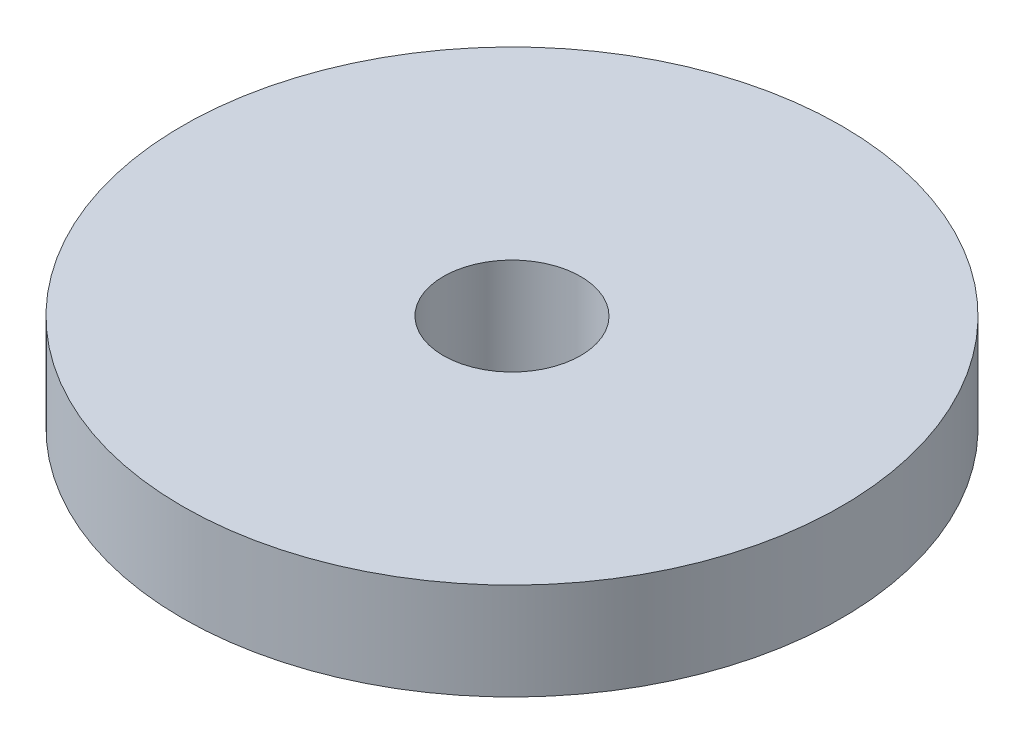
ISO-10303-21;
HEADER;
FILE_DESCRIPTION(('STEP AP214'),'2;1');
FILE_NAME('part.step','',(''),(''),'','','');
FILE_SCHEMA(('AUTOMOTIVE_DESIGN { 1 0 10303 214 1 1 1 1 }'));
ENDSEC;
DATA;
#1=APPLICATION_CONTEXT('core data for automotive mechanical design processes');
#2=APPLICATION_PROTOCOL_DEFINITION('international standard','automotive_design',2000,#1);
#3=PRODUCT_CONTEXT('',#1,'mechanical');
#4=PRODUCT('Part','Part','',(#3));
#5=PRODUCT_RELATED_PRODUCT_CATEGORY('part','',(#4));
#6=PRODUCT_DEFINITION_FORMATION('','',#4);
#7=PRODUCT_DEFINITION_CONTEXT('part definition',#1,'design');
#8=PRODUCT_DEFINITION('design','',#6,#7);
#9=PRODUCT_DEFINITION_SHAPE('','',#8);
#10=(LENGTH_UNIT() NAMED_UNIT(*) SI_UNIT(.MILLI.,.METRE.));
#11=(NAMED_UNIT(*) PLANE_ANGLE_UNIT() SI_UNIT($,.RADIAN.));
#12=(NAMED_UNIT(*) SI_UNIT($,.STERADIAN.) SOLID_ANGLE_UNIT());
#13=UNCERTAINTY_MEASURE_WITH_UNIT(LENGTH_MEASURE(1.E-05),#10,'distance_accuracy_value','');
#14=(GEOMETRIC_REPRESENTATION_CONTEXT(3) GLOBAL_UNCERTAINTY_ASSIGNED_CONTEXT((#13)) GLOBAL_UNIT_ASSIGNED_CONTEXT((#10,
#11,#12)) REPRESENTATION_CONTEXT('',''));
#15=CARTESIAN_POINT('',(0.,0.,0.));
#16=DIRECTION('',(0.,0.,1.));
#17=DIRECTION('',(1.,0.,0.));
#18=AXIS2_PLACEMENT_3D('',#15,#16,#17);
#19=CARTESIAN_POINT('',(0.,3.175,0.));
#20=DIRECTION('',(0.,-1.,0.));
#21=DIRECTION('',(0.,0.,-1.));
#22=AXIS2_PLACEMENT_3D('',#19,#20,#21);
#23=CYLINDRICAL_SURFACE('',#22,10.795);
#24=CARTESIAN_POINT('',(0.,3.175,0.));
#25=DIRECTION('',(0.,1.,0.));
#26=DIRECTION('',(0.,0.,1.));
#27=AXIS2_PLACEMENT_3D('',#24,#25,#26);
#28=CIRCLE('',#27,10.795);
#29=CARTESIAN_POINT('',(0.,3.175,10.795));
#30=VERTEX_POINT('',#29);
#31=EDGE_CURVE('E10',#30,#30,#28,.T.);
#32=ORIENTED_EDGE('',*,*,#31,.F.);
#33=EDGE_LOOP('',(#32));
#34=FACE_BOUND('',#33,.T.);
#35=CARTESIAN_POINT('',(0.,0.,0.));
#36=DIRECTION('',(0.,1.,0.));
#37=DIRECTION('',(0.,0.,1.));
#38=AXIS2_PLACEMENT_3D('',#35,#36,#37);
#39=CIRCLE('',#38,10.795);
#40=CARTESIAN_POINT('',(0.,0.,10.795));
#41=VERTEX_POINT('',#40);
#42=EDGE_CURVE('E49',#41,#41,#39,.T.);
#43=ORIENTED_EDGE('',*,*,#42,.T.);
#44=EDGE_LOOP('',(#43));
#45=FACE_BOUND('',#44,.T.);
#46=ADVANCED_FACE('F41',(#34,#45),#23,.T.);
#47=CARTESIAN_POINT('',(0.,3.175,0.));
#48=DIRECTION('',(0.,1.,0.));
#49=DIRECTION('',(0.,0.,1.));
#50=AXIS2_PLACEMENT_3D('',#47,#48,#49);
#51=PLANE('',#50);
#52=CARTESIAN_POINT('',(0.,3.175,0.));
#53=DIRECTION('',(0.,1.,0.));
#54=DIRECTION('',(0.,0.,1.));
#55=AXIS2_PLACEMENT_3D('',#52,#53,#54);
#56=CIRCLE('',#55,2.2479);
#57=CARTESIAN_POINT('',(0.,3.175,2.2479));
#58=VERTEX_POINT('',#57);
#59=EDGE_CURVE('E56',#58,#58,#56,.T.);
#60=ORIENTED_EDGE('',*,*,#59,.F.);
#61=EDGE_LOOP('',(#60));
#62=FACE_BOUND('',#61,.T.);
#63=ORIENTED_EDGE('',*,*,#31,.T.);
#64=EDGE_LOOP('',(#63));
#65=FACE_BOUND('',#64,.T.);
#66=ADVANCED_FACE('F74',(#62,#65),#51,.T.);
#67=CARTESIAN_POINT('',(0.,0.,0.));
#68=DIRECTION('',(0.,1.,0.));
#69=DIRECTION('',(0.,0.,1.));
#70=AXIS2_PLACEMENT_3D('',#67,#68,#69);
#71=PLANE('',#70);
#72=CARTESIAN_POINT('',(0.,0.,0.));
#73=DIRECTION('',(0.,1.,0.));
#74=DIRECTION('',(0.,0.,1.));
#75=AXIS2_PLACEMENT_3D('',#72,#73,#74);
#76=CIRCLE('',#75,2.2479);
#77=CARTESIAN_POINT('',(0.,0.,2.2479));
#78=VERTEX_POINT('',#77);
#79=EDGE_CURVE('E44',#78,#78,#76,.T.);
#80=ORIENTED_EDGE('',*,*,#79,.T.);
#81=EDGE_LOOP('',(#80));
#82=FACE_BOUND('',#81,.T.);
#83=ORIENTED_EDGE('',*,*,#42,.F.);
#84=EDGE_LOOP('',(#83));
#85=FACE_BOUND('',#84,.T.);
#86=ADVANCED_FACE('F65',(#82,#85),#71,.F.);
#87=CARTESIAN_POINT('',(0.,3.175,0.));
#88=DIRECTION('',(0.,1.,0.));
#89=DIRECTION('',(0.,0.,1.));
#90=AXIS2_PLACEMENT_3D('',#87,#88,#89);
#91=CYLINDRICAL_SURFACE('',#90,2.2479);
#92=ORIENTED_EDGE('',*,*,#59,.T.);
#93=EDGE_LOOP('',(#92));
#94=FACE_BOUND('',#93,.T.);
#95=ORIENTED_EDGE('',*,*,#79,.F.);
#96=EDGE_LOOP('',(#95));
#97=FACE_BOUND('',#96,.T.);
#98=ADVANCED_FACE('F68',(#94,#97),#91,.F.);
#99=CLOSED_SHELL('',(#46,#66,#86,#98));
#100=MANIFOLD_SOLID_BREP('B2',#99);
#101=ADVANCED_BREP_SHAPE_REPRESENTATION('',(#18,#100),#14);
#102=SHAPE_DEFINITION_REPRESENTATION(#9,#101);
ENDSEC;
END-ISO-10303-21;
